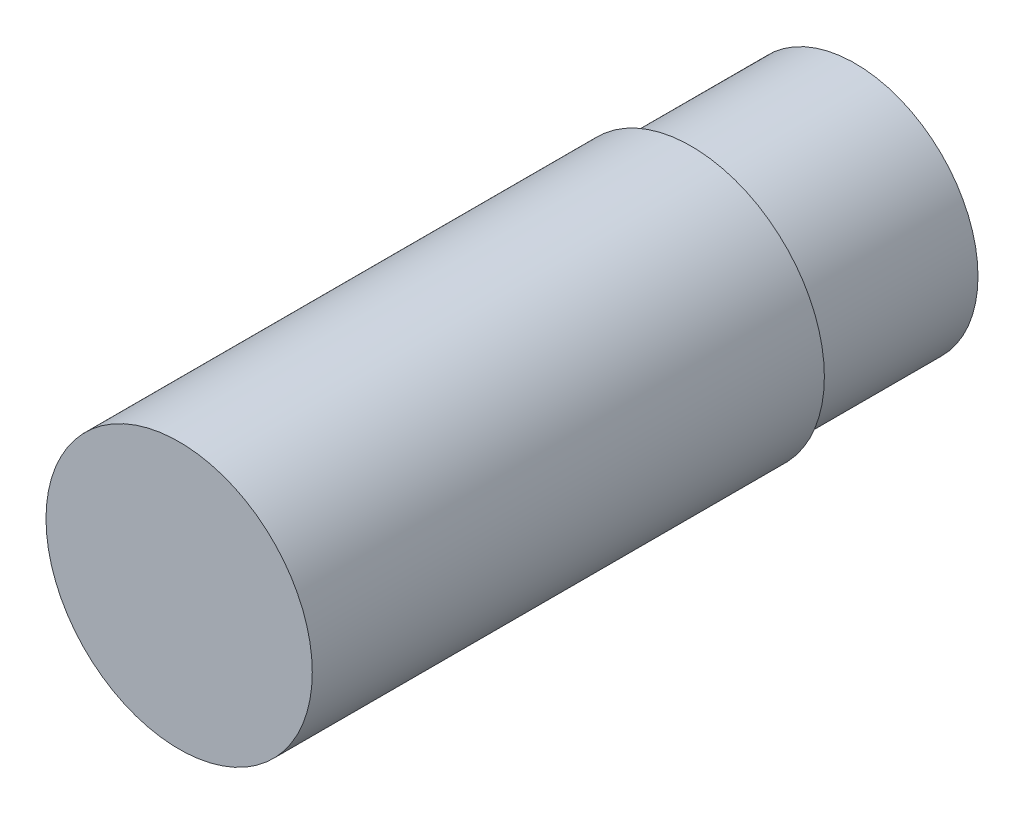
ISO-10303-21;
HEADER;
FILE_DESCRIPTION(('STEP AP214'),'2;1');
FILE_NAME('part.step','',(''),(''),'','','');
FILE_SCHEMA(('AUTOMOTIVE_DESIGN { 1 0 10303 214 1 1 1 1 }'));
ENDSEC;
DATA;
#1=APPLICATION_CONTEXT('core data for automotive mechanical design processes');
#2=APPLICATION_PROTOCOL_DEFINITION('international standard','automotive_design',2000,#1);
#3=PRODUCT_CONTEXT('',#1,'mechanical');
#4=PRODUCT('Part','Part','',(#3));
#5=PRODUCT_RELATED_PRODUCT_CATEGORY('part','',(#4));
#6=PRODUCT_DEFINITION_FORMATION('','',#4);
#7=PRODUCT_DEFINITION_CONTEXT('part definition',#1,'design');
#8=PRODUCT_DEFINITION('design','',#6,#7);
#9=PRODUCT_DEFINITION_SHAPE('','',#8);
#10=(LENGTH_UNIT() NAMED_UNIT(*) SI_UNIT(.MILLI.,.METRE.));
#11=(NAMED_UNIT(*) PLANE_ANGLE_UNIT() SI_UNIT($,.RADIAN.));
#12=(NAMED_UNIT(*) SI_UNIT($,.STERADIAN.) SOLID_ANGLE_UNIT());
#13=UNCERTAINTY_MEASURE_WITH_UNIT(LENGTH_MEASURE(1.E-05),#10,'distance_accuracy_value','');
#14=(GEOMETRIC_REPRESENTATION_CONTEXT(3) GLOBAL_UNCERTAINTY_ASSIGNED_CONTEXT((#13)) GLOBAL_UNIT_ASSIGNED_CONTEXT((#10,
#11,#12)) REPRESENTATION_CONTEXT('',''));
#15=CARTESIAN_POINT('',(0.,0.,0.));
#16=DIRECTION('',(0.,0.,1.));
#17=DIRECTION('',(1.,0.,0.));
#18=AXIS2_PLACEMENT_3D('',#15,#16,#17);
#19=CARTESIAN_POINT('',(0.,0.,2.032));
#20=DIRECTION('',(0.,0.,-1.));
#21=DIRECTION('',(-1.,0.,0.));
#22=AXIS2_PLACEMENT_3D('',#19,#20,#21);
#23=CYLINDRICAL_SURFACE('',#22,1.524);
#24=CARTESIAN_POINT('',(0.,0.,2.032));
#25=DIRECTION('',(0.,0.,1.));
#26=DIRECTION('',(1.,0.,0.));
#27=AXIS2_PLACEMENT_3D('',#24,#25,#26);
#28=CIRCLE('',#27,1.524);
#29=CARTESIAN_POINT('',(1.524,0.,2.032));
#30=VERTEX_POINT('',#29);
#31=EDGE_CURVE('E10',#30,#30,#28,.T.);
#32=ORIENTED_EDGE('',*,*,#31,.F.);
#33=EDGE_LOOP('',(#32));
#34=FACE_BOUND('',#33,.T.);
#35=CARTESIAN_POINT('',(0.,0.,0.));
#36=DIRECTION('',(0.,0.,1.));
#37=DIRECTION('',(1.,0.,0.));
#38=AXIS2_PLACEMENT_3D('',#35,#36,#37);
#39=CIRCLE('',#38,1.524);
#40=CARTESIAN_POINT('',(1.524,0.,0.));
#41=VERTEX_POINT('',#40);
#42=EDGE_CURVE('E36',#41,#41,#39,.T.);
#43=ORIENTED_EDGE('',*,*,#42,.T.);
#44=EDGE_LOOP('',(#43));
#45=FACE_BOUND('',#44,.T.);
#46=ADVANCED_FACE('F33',(#34,#45),#23,.T.);
#47=CARTESIAN_POINT('',(0.,0.,0.));
#48=DIRECTION('',(0.,0.,1.));
#49=DIRECTION('',(1.,0.,0.));
#50=AXIS2_PLACEMENT_3D('',#47,#48,#49);
#51=PLANE('',#50);
#52=ORIENTED_EDGE('',*,*,#42,.F.);
#53=EDGE_LOOP('',(#52));
#54=FACE_BOUND('',#53,.T.);
#55=ADVANCED_FACE('F56',(#54),#51,.F.);
#56=CARTESIAN_POINT('',(0.,0.,8.382));
#57=DIRECTION('',(0.,0.,-1.));
#58=DIRECTION('',(-1.,0.,0.));
#59=AXIS2_PLACEMENT_3D('',#56,#57,#58);
#60=CYLINDRICAL_SURFACE('',#59,1.651);
#61=CARTESIAN_POINT('',(0.,0.,8.382));
#62=DIRECTION('',(0.,0.,1.));
#63=DIRECTION('',(1.,0.,0.));
#64=AXIS2_PLACEMENT_3D('',#61,#62,#63);
#65=CIRCLE('',#64,1.651);
#66=CARTESIAN_POINT('',(1.651,0.,8.382));
#67=VERTEX_POINT('',#66);
#68=EDGE_CURVE('E43',#67,#67,#65,.T.);
#69=ORIENTED_EDGE('',*,*,#68,.F.);
#70=EDGE_LOOP('',(#69));
#71=FACE_BOUND('',#70,.T.);
#72=CARTESIAN_POINT('',(0.,0.,2.032));
#73=DIRECTION('',(0.,0.,1.));
#74=DIRECTION('',(1.,0.,0.));
#75=AXIS2_PLACEMENT_3D('',#72,#73,#74);
#76=CIRCLE('',#75,1.651);
#77=CARTESIAN_POINT('',(1.651,0.,2.032));
#78=VERTEX_POINT('',#77);
#79=EDGE_CURVE('E45',#78,#78,#76,.T.);
#80=ORIENTED_EDGE('',*,*,#79,.T.);
#81=EDGE_LOOP('',(#80));
#82=FACE_BOUND('',#81,.T.);
#83=ADVANCED_FACE('F53',(#71,#82),#60,.T.);
#84=CARTESIAN_POINT('',(0.,0.,8.382));
#85=DIRECTION('',(0.,0.,1.));
#86=DIRECTION('',(1.,0.,0.));
#87=AXIS2_PLACEMENT_3D('',#84,#85,#86);
#88=PLANE('',#87);
#89=ORIENTED_EDGE('',*,*,#68,.T.);
#90=EDGE_LOOP('',(#89));
#91=FACE_BOUND('',#90,.T.);
#92=ADVANCED_FACE('F51',(#91),#88,.T.);
#93=CARTESIAN_POINT('',(0.,0.,2.032));
#94=DIRECTION('',(0.,0.,1.));
#95=DIRECTION('',(1.,0.,0.));
#96=AXIS2_PLACEMENT_3D('',#93,#94,#95);
#97=PLANE('',#96);
#98=ORIENTED_EDGE('',*,*,#31,.T.);
#99=EDGE_LOOP('',(#98));
#100=FACE_BOUND('',#99,.T.);
#101=ORIENTED_EDGE('',*,*,#79,.F.);
#102=EDGE_LOOP('',(#101));
#103=FACE_BOUND('',#102,.T.);
#104=ADVANCED_FACE('F60',(#100,#103),#97,.F.);
#105=CLOSED_SHELL('',(#46,#55,#83,#92,#104));
#106=MANIFOLD_SOLID_BREP('B2',#105);
#107=ADVANCED_BREP_SHAPE_REPRESENTATION('',(#18,#106),#14);
#108=SHAPE_DEFINITION_REPRESENTATION(#9,#107);
ENDSEC;
END-ISO-10303-21;
